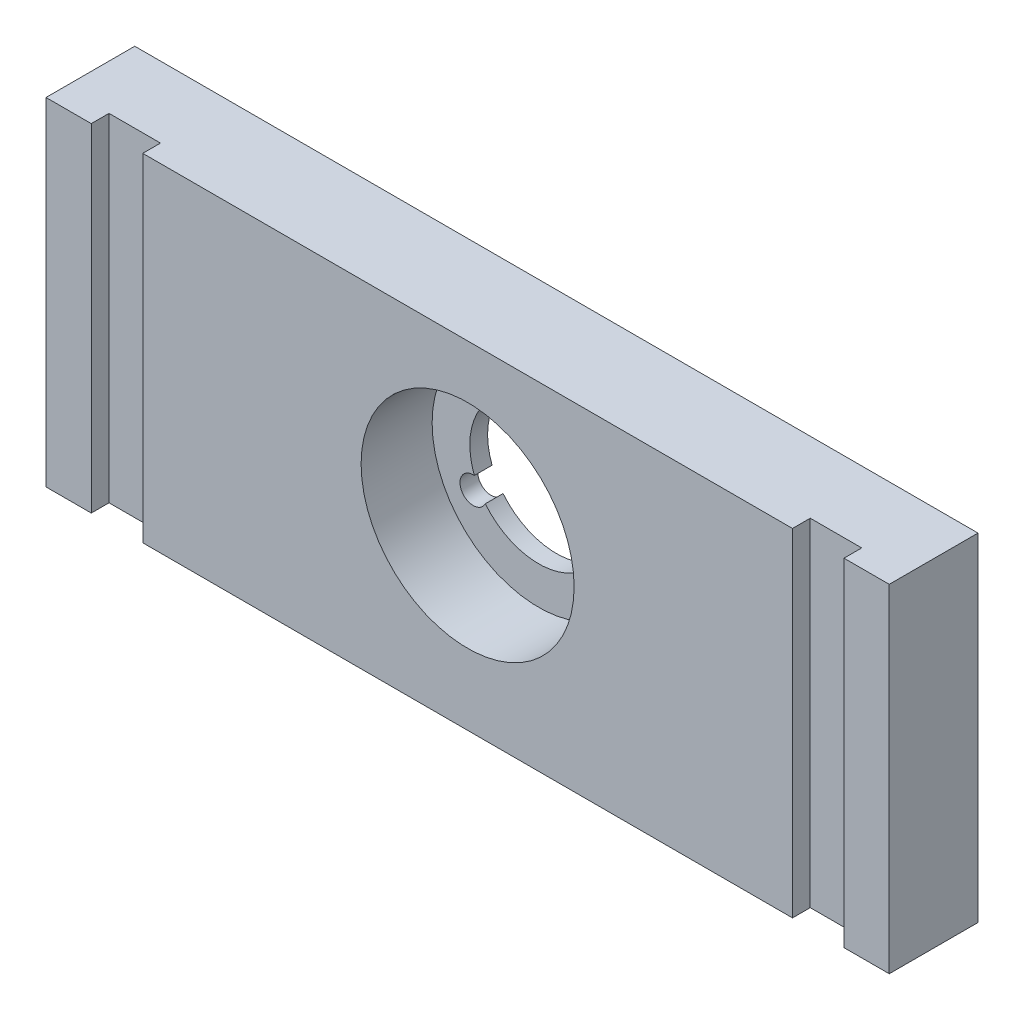
ISO-10303-21;
HEADER;
FILE_DESCRIPTION(('STEP AP214'),'2;1');
FILE_NAME('part.step','',(''),(''),'','','');
FILE_SCHEMA(('AUTOMOTIVE_DESIGN { 1 0 10303 214 1 1 1 1 }'));
ENDSEC;
DATA;
#1=APPLICATION_CONTEXT('core data for automotive mechanical design processes');
#2=APPLICATION_PROTOCOL_DEFINITION('international standard','automotive_design',2000,#1);
#3=PRODUCT_CONTEXT('',#1,'mechanical');
#4=PRODUCT('Part','Part','',(#3));
#5=PRODUCT_RELATED_PRODUCT_CATEGORY('part','',(#4));
#6=PRODUCT_DEFINITION_FORMATION('','',#4);
#7=PRODUCT_DEFINITION_CONTEXT('part definition',#1,'design');
#8=PRODUCT_DEFINITION('design','',#6,#7);
#9=PRODUCT_DEFINITION_SHAPE('','',#8);
#10=(LENGTH_UNIT() NAMED_UNIT(*) SI_UNIT(.MILLI.,.METRE.));
#11=(NAMED_UNIT(*) PLANE_ANGLE_UNIT() SI_UNIT($,.RADIAN.));
#12=(NAMED_UNIT(*) SI_UNIT($,.STERADIAN.) SOLID_ANGLE_UNIT());
#13=UNCERTAINTY_MEASURE_WITH_UNIT(LENGTH_MEASURE(1.E-05),#10,'distance_accuracy_value','');
#14=(GEOMETRIC_REPRESENTATION_CONTEXT(3) GLOBAL_UNCERTAINTY_ASSIGNED_CONTEXT((#13)) GLOBAL_UNIT_ASSIGNED_CONTEXT((#10,
#11,#12)) REPRESENTATION_CONTEXT('',''));
#15=CARTESIAN_POINT('',(0.,0.,0.));
#16=DIRECTION('',(0.,0.,1.));
#17=DIRECTION('',(1.,0.,0.));
#18=AXIS2_PLACEMENT_3D('',#15,#16,#17);
#19=CARTESIAN_POINT('',(0.,0.,10.));
#20=DIRECTION('',(0.,0.,-1.));
#21=DIRECTION('',(-1.,0.,0.));
#22=AXIS2_PLACEMENT_3D('',#19,#20,#21);
#23=PLANE('',#22);
#24=CARTESIAN_POINT('',(47.5,-18.,10.));
#25=DIRECTION('',(0.,0.,1.));
#26=DIRECTION('',(1.,0.,0.));
#27=AXIS2_PLACEMENT_3D('',#24,#25,#26);
#28=CIRCLE('',#27,12.);
#29=CARTESIAN_POINT('',(59.5,-18.,10.));
#30=VERTEX_POINT('',#29);
#31=EDGE_CURVE('E207',#30,#30,#28,.T.);
#32=ORIENTED_EDGE('',*,*,#31,.F.);
#33=EDGE_LOOP('',(#32));
#34=FACE_BOUND('',#33,.T.);
#35=DIRECTION('',(1.,0.,0.));
#36=VECTOR('',#35,1.);
#37=CARTESIAN_POINT('',(95.,-38.,10.));
#38=LINE('',#37,#36);
#39=CARTESIAN_POINT('',(10.9,-38.,10.));
#40=VERTEX_POINT('',#39);
#41=CARTESIAN_POINT('',(84.1,-38.,10.));
#42=VERTEX_POINT('',#41);
#43=EDGE_CURVE('E274',#40,#42,#38,.T.);
#44=ORIENTED_EDGE('',*,*,#43,.T.);
#45=DIRECTION('',(0.,-1.,0.));
#46=VECTOR('',#45,1.);
#47=CARTESIAN_POINT('',(84.1,-38.,10.));
#48=LINE('',#47,#46);
#49=CARTESIAN_POINT('',(84.1,0.,10.));
#50=VERTEX_POINT('',#49);
#51=EDGE_CURVE('E161',#50,#42,#48,.T.);
#52=ORIENTED_EDGE('',*,*,#51,.F.);
#53=DIRECTION('',(-1.,0.,0.));
#54=VECTOR('',#53,1.);
#55=CARTESIAN_POINT('',(0.,0.,10.));
#56=LINE('',#55,#54);
#57=CARTESIAN_POINT('',(10.9,0.,10.));
#58=VERTEX_POINT('',#57);
#59=EDGE_CURVE('E281',#50,#58,#56,.T.);
#60=ORIENTED_EDGE('',*,*,#59,.T.);
#61=DIRECTION('',(0.,1.,0.));
#62=VECTOR('',#61,1.);
#63=CARTESIAN_POINT('',(10.9,-38.,10.));
#64=LINE('',#63,#62);
#65=EDGE_CURVE('E186',#40,#58,#64,.T.);
#66=ORIENTED_EDGE('',*,*,#65,.F.);
#67=EDGE_LOOP('',(#44,#52,#60,#66));
#68=FACE_BOUND('',#67,.T.);
#69=ADVANCED_FACE('F31',(#34,#68),#23,.F.);
#70=CARTESIAN_POINT('',(0.,-38.,10.));
#71=VERTEX_POINT('',#70);
#72=CARTESIAN_POINT('',(5.1,-38.,10.));
#73=VERTEX_POINT('',#72);
#74=EDGE_CURVE('E270',#71,#73,#38,.T.);
#75=ORIENTED_EDGE('',*,*,#74,.T.);
#76=DIRECTION('',(0.,-1.,0.));
#77=VECTOR('',#76,1.);
#78=CARTESIAN_POINT('',(5.1,-38.,10.));
#79=LINE('',#78,#77);
#80=CARTESIAN_POINT('',(5.10000000000001,0.,10.));
#81=VERTEX_POINT('',#80);
#82=EDGE_CURVE('E193',#81,#73,#79,.T.);
#83=ORIENTED_EDGE('',*,*,#82,.F.);
#84=CARTESIAN_POINT('',(0.,0.,10.));
#85=VERTEX_POINT('',#84);
#86=EDGE_CURVE('E276',#81,#85,#56,.T.);
#87=ORIENTED_EDGE('',*,*,#86,.T.);
#88=DIRECTION('',(0.,-1.,0.));
#89=VECTOR('',#88,1.);
#90=CARTESIAN_POINT('',(0.,-38.,10.));
#91=LINE('',#90,#89);
#92=EDGE_CURVE('E265',#85,#71,#91,.T.);
#93=ORIENTED_EDGE('',*,*,#92,.T.);
#94=EDGE_LOOP('',(#75,#83,#87,#93));
#95=FACE_BOUND('',#94,.T.);
#96=ADVANCED_FACE('F334',(#95),#23,.F.);
#97=CARTESIAN_POINT('',(47.5,-18.,10.));
#98=DIRECTION('',(0.,0.,-1.));
#99=DIRECTION('',(-1.,0.,0.));
#100=AXIS2_PLACEMENT_3D('',#97,#98,#99);
#101=CYLINDRICAL_SURFACE('',#100,7.75);
#102=DIRECTION('',(0.,0.,-1.));
#103=VECTOR('',#102,1.);
#104=CARTESIAN_POINT('',(54.7439441639615,-20.7545912490619,10.));
#105=LINE('',#104,#103);
#106=CARTESIAN_POINT('',(54.7439441639615,-20.7545912490619,2.));
#107=VERTEX_POINT('',#106);
#108=CARTESIAN_POINT('',(54.7439441639615,-20.7545912490619,0.));
#109=VERTEX_POINT('',#108);
#110=EDGE_CURVE('E252',#107,#109,#105,.T.);
#111=ORIENTED_EDGE('',*,*,#110,.F.);
#112=CARTESIAN_POINT('',(47.5,-18.,2.));
#113=DIRECTION('',(0.,0.,1.));
#114=DIRECTION('',(1.,0.,0.));
#115=AXIS2_PLACEMENT_3D('',#112,#113,#114);
#116=CIRCLE('',#115,7.75);
#117=CARTESIAN_POINT('',(48.7364260832507,-10.3492647058823,2.));
#118=VERTEX_POINT('',#117);
#119=EDGE_CURVE('E231',#107,#118,#116,.T.);
#120=ORIENTED_EDGE('',*,*,#119,.T.);
#121=DIRECTION('',(0.,0.,-1.));
#122=VECTOR('',#121,1.);
#123=CARTESIAN_POINT('',(48.7364260832507,-10.3492647058823,10.));
#124=LINE('',#123,#122);
#125=CARTESIAN_POINT('',(48.7364260832507,-10.3492647058823,0.));
#126=VERTEX_POINT('',#125);
#127=EDGE_CURVE('E262',#118,#126,#124,.T.);
#128=ORIENTED_EDGE('',*,*,#127,.T.);
#129=CARTESIAN_POINT('',(47.5,-18.,0.));
#130=DIRECTION('',(0.,0.,1.));
#131=DIRECTION('',(1.,0.,0.));
#132=AXIS2_PLACEMENT_3D('',#129,#130,#131);
#133=CIRCLE('',#132,7.75);
#134=EDGE_CURVE('E234',#109,#126,#133,.T.);
#135=ORIENTED_EDGE('',*,*,#134,.F.);
#136=EDGE_LOOP('',(#111,#120,#128,#135));
#137=FACE_BOUND('',#136,.T.);
#138=ADVANCED_FACE('F336',(#137),#101,.F.);
#139=CARTESIAN_POINT('',(47.5,-9.49999999999996,10.));
#140=DIRECTION('',(0.,0.,-1.));
#141=DIRECTION('',(-1.,0.,0.));
#142=AXIS2_PLACEMENT_3D('',#139,#140,#141);
#143=CYLINDRICAL_SURFACE('',#142,1.5);
#144=ORIENTED_EDGE('',*,*,#127,.F.);
#145=CARTESIAN_POINT('',(47.5,-9.49999999999996,2.));
#146=DIRECTION('',(0.,0.,1.));
#147=DIRECTION('',(1.,0.,0.));
#148=AXIS2_PLACEMENT_3D('',#145,#146,#147);
#149=CIRCLE('',#148,1.5);
#150=CARTESIAN_POINT('',(46.2635739167494,-10.3492647058823,2.));
#151=VERTEX_POINT('',#150);
#152=EDGE_CURVE('E228',#118,#151,#149,.T.);
#153=ORIENTED_EDGE('',*,*,#152,.T.);
#154=DIRECTION('',(0.,0.,-1.));
#155=VECTOR('',#154,1.);
#156=CARTESIAN_POINT('',(46.2635739167494,-10.3492647058823,10.));
#157=LINE('',#156,#155);
#158=CARTESIAN_POINT('',(46.2635739167494,-10.3492647058823,0.));
#159=VERTEX_POINT('',#158);
#160=EDGE_CURVE('E260',#151,#159,#157,.T.);
#161=ORIENTED_EDGE('',*,*,#160,.T.);
#162=CARTESIAN_POINT('',(47.5,-9.49999999999996,0.));
#163=DIRECTION('',(0.,0.,1.));
#164=DIRECTION('',(1.,0.,0.));
#165=AXIS2_PLACEMENT_3D('',#162,#163,#164);
#166=CIRCLE('',#165,1.5);
#167=EDGE_CURVE('E237',#126,#159,#166,.T.);
#168=ORIENTED_EDGE('',*,*,#167,.F.);
#169=EDGE_LOOP('',(#144,#153,#161,#168));
#170=FACE_BOUND('',#169,.T.);
#171=ADVANCED_FACE('F342',(#170),#143,.F.);
#172=CARTESIAN_POINT('',(47.5,-18.,10.));
#173=DIRECTION('',(0.,0.,-1.));
#174=DIRECTION('',(-1.,0.,0.));
#175=AXIS2_PLACEMENT_3D('',#172,#173,#174);
#176=CYLINDRICAL_SURFACE('',#175,7.75);
#177=ORIENTED_EDGE('',*,*,#160,.F.);
#178=CARTESIAN_POINT('',(47.5,-18.,2.));
#179=DIRECTION('',(0.,0.,1.));
#180=DIRECTION('',(1.,0.,0.));
#181=AXIS2_PLACEMENT_3D('',#178,#179,#180);
#182=CIRCLE('',#181,7.75);
#183=CARTESIAN_POINT('',(40.2560558360386,-20.754591249062,2.));
#184=VERTEX_POINT('',#183);
#185=EDGE_CURVE('E225',#151,#184,#182,.T.);
#186=ORIENTED_EDGE('',*,*,#185,.T.);
#187=DIRECTION('',(0.,0.,-1.));
#188=VECTOR('',#187,1.);
#189=CARTESIAN_POINT('',(40.2560558360386,-20.754591249062,10.));
#190=LINE('',#189,#188);
#191=CARTESIAN_POINT('',(40.2560558360386,-20.754591249062,0.));
#192=VERTEX_POINT('',#191);
#193=EDGE_CURVE('E258',#184,#192,#190,.T.);
#194=ORIENTED_EDGE('',*,*,#193,.T.);
#195=CARTESIAN_POINT('',(47.5,-18.,0.));
#196=DIRECTION('',(0.,0.,1.));
#197=DIRECTION('',(1.,0.,0.));
#198=AXIS2_PLACEMENT_3D('',#195,#196,#197);
#199=CIRCLE('',#198,7.75);
#200=EDGE_CURVE('E240',#159,#192,#199,.T.);
#201=ORIENTED_EDGE('',*,*,#200,.F.);
#202=EDGE_LOOP('',(#177,#186,#194,#201));
#203=FACE_BOUND('',#202,.T.);
#204=ADVANCED_FACE('F369',(#203),#176,.F.);
#205=CARTESIAN_POINT('',(40.1387840678324,-22.25,10.));
#206=DIRECTION('',(0.,0.,-1.));
#207=DIRECTION('',(-1.,0.,0.));
#208=AXIS2_PLACEMENT_3D('',#205,#206,#207);
#209=CYLINDRICAL_SURFACE('',#208,1.5);
#210=ORIENTED_EDGE('',*,*,#193,.F.);
#211=CARTESIAN_POINT('',(40.1387840678324,-22.25,2.));
#212=DIRECTION('',(0.,0.,1.));
#213=DIRECTION('',(1.,0.,0.));
#214=AXIS2_PLACEMENT_3D('',#211,#212,#213);
#215=CIRCLE('',#214,1.5);
#216=CARTESIAN_POINT('',(41.4924819192894,-22.8961440450557,2.));
#217=VERTEX_POINT('',#216);
#218=EDGE_CURVE('E222',#184,#217,#215,.T.);
#219=ORIENTED_EDGE('',*,*,#218,.T.);
#220=DIRECTION('',(0.,0.,-1.));
#221=VECTOR('',#220,1.);
#222=CARTESIAN_POINT('',(41.4924819192894,-22.8961440450557,10.));
#223=LINE('',#222,#221);
#224=CARTESIAN_POINT('',(41.4924819192894,-22.8961440450557,0.));
#225=VERTEX_POINT('',#224);
#226=EDGE_CURVE('E256',#217,#225,#223,.T.);
#227=ORIENTED_EDGE('',*,*,#226,.T.);
#228=CARTESIAN_POINT('',(40.1387840678324,-22.25,0.));
#229=DIRECTION('',(0.,0.,1.));
#230=DIRECTION('',(1.,0.,0.));
#231=AXIS2_PLACEMENT_3D('',#228,#229,#230);
#232=CIRCLE('',#231,1.5);
#233=EDGE_CURVE('E243',#192,#225,#232,.T.);
#234=ORIENTED_EDGE('',*,*,#233,.F.);
#235=EDGE_LOOP('',(#210,#219,#227,#234));
#236=FACE_BOUND('',#235,.T.);
#237=ADVANCED_FACE('F359',(#236),#209,.F.);
#238=CARTESIAN_POINT('',(47.5,-18.,10.));
#239=DIRECTION('',(0.,0.,-1.));
#240=DIRECTION('',(-1.,0.,0.));
#241=AXIS2_PLACEMENT_3D('',#238,#239,#240);
#242=CYLINDRICAL_SURFACE('',#241,7.75);
#243=ORIENTED_EDGE('',*,*,#226,.F.);
#244=CARTESIAN_POINT('',(47.5,-18.,2.));
#245=DIRECTION('',(0.,0.,1.));
#246=DIRECTION('',(1.,0.,0.));
#247=AXIS2_PLACEMENT_3D('',#244,#245,#246);
#248=CIRCLE('',#247,7.75);
#249=CARTESIAN_POINT('',(53.5075180807109,-22.8961440450554,2.));
#250=VERTEX_POINT('',#249);
#251=EDGE_CURVE('E217',#217,#250,#248,.T.);
#252=ORIENTED_EDGE('',*,*,#251,.T.);
#253=DIRECTION('',(0.,0.,-1.));
#254=VECTOR('',#253,1.);
#255=CARTESIAN_POINT('',(53.5075180807109,-22.8961440450554,10.));
#256=LINE('',#255,#254);
#257=CARTESIAN_POINT('',(53.5075180807109,-22.8961440450554,0.));
#258=VERTEX_POINT('',#257);
#259=EDGE_CURVE('E254',#250,#258,#256,.T.);
#260=ORIENTED_EDGE('',*,*,#259,.T.);
#261=CARTESIAN_POINT('',(47.5,-18.,0.));
#262=DIRECTION('',(0.,0.,1.));
#263=DIRECTION('',(1.,0.,0.));
#264=AXIS2_PLACEMENT_3D('',#261,#262,#263);
#265=CIRCLE('',#264,7.75);
#266=EDGE_CURVE('E246',#225,#258,#265,.T.);
#267=ORIENTED_EDGE('',*,*,#266,.F.);
#268=EDGE_LOOP('',(#243,#252,#260,#267));
#269=FACE_BOUND('',#268,.T.);
#270=ADVANCED_FACE('F353',(#269),#242,.F.);
#271=CARTESIAN_POINT('',(54.8612159321678,-22.2499999999998,10.));
#272=DIRECTION('',(0.,0.,-1.));
#273=DIRECTION('',(-1.,0.,0.));
#274=AXIS2_PLACEMENT_3D('',#271,#272,#273);
#275=CYLINDRICAL_SURFACE('',#274,1.5);
#276=ORIENTED_EDGE('',*,*,#259,.F.);
#277=CARTESIAN_POINT('',(54.8612159321678,-22.2499999999998,2.));
#278=DIRECTION('',(0.,0.,1.));
#279=DIRECTION('',(1.,0.,0.));
#280=AXIS2_PLACEMENT_3D('',#277,#278,#279);
#281=CIRCLE('',#280,1.5);
#282=EDGE_CURVE('E11',#250,#107,#281,.T.);
#283=ORIENTED_EDGE('',*,*,#282,.T.);
#284=ORIENTED_EDGE('',*,*,#110,.T.);
#285=CARTESIAN_POINT('',(54.8612159321678,-22.2499999999998,0.));
#286=DIRECTION('',(0.,0.,1.));
#287=DIRECTION('',(1.,0.,0.));
#288=AXIS2_PLACEMENT_3D('',#285,#286,#287);
#289=CIRCLE('',#288,1.5);
#290=EDGE_CURVE('E249',#258,#109,#289,.T.);
#291=ORIENTED_EDGE('',*,*,#290,.F.);
#292=EDGE_LOOP('',(#276,#283,#284,#291));
#293=FACE_BOUND('',#292,.T.);
#294=ADVANCED_FACE('F348',(#293),#275,.F.);
#295=CARTESIAN_POINT('',(95.,0.,10.));
#296=VERTEX_POINT('',#295);
#297=CARTESIAN_POINT('',(89.9,0.,10.));
#298=VERTEX_POINT('',#297);
#299=EDGE_CURVE('E277',#296,#298,#56,.T.);
#300=ORIENTED_EDGE('',*,*,#299,.T.);
#301=DIRECTION('',(0.,1.,0.));
#302=VECTOR('',#301,1.);
#303=CARTESIAN_POINT('',(89.9,-38.,10.));
#304=LINE('',#303,#302);
#305=CARTESIAN_POINT('',(89.9,-38.,10.));
#306=VERTEX_POINT('',#305);
#307=EDGE_CURVE('E174',#306,#298,#304,.T.);
#308=ORIENTED_EDGE('',*,*,#307,.F.);
#309=CARTESIAN_POINT('',(95.,-38.,10.));
#310=VERTEX_POINT('',#309);
#311=EDGE_CURVE('E268',#306,#310,#38,.T.);
#312=ORIENTED_EDGE('',*,*,#311,.T.);
#313=DIRECTION('',(0.,1.,0.));
#314=VECTOR('',#313,1.);
#315=CARTESIAN_POINT('',(95.,0.,10.));
#316=LINE('',#315,#314);
#317=EDGE_CURVE('E273',#310,#296,#316,.T.);
#318=ORIENTED_EDGE('',*,*,#317,.T.);
#319=EDGE_LOOP('',(#300,#308,#312,#318));
#320=FACE_BOUND('',#319,.T.);
#321=ADVANCED_FACE('F318',(#320),#23,.F.);
#322=CARTESIAN_POINT('',(0.,0.,0.));
#323=DIRECTION('',(0.,0.,-1.));
#324=DIRECTION('',(-1.,0.,0.));
#325=AXIS2_PLACEMENT_3D('',#322,#323,#324);
#326=PLANE('',#325);
#327=DIRECTION('',(0.,-1.,0.));
#328=VECTOR('',#327,1.);
#329=CARTESIAN_POINT('',(0.,-38.,0.));
#330=LINE('',#329,#328);
#331=CARTESIAN_POINT('',(0.,0.,0.));
#332=VERTEX_POINT('',#331);
#333=CARTESIAN_POINT('',(0.,-38.,0.));
#334=VERTEX_POINT('',#333);
#335=EDGE_CURVE('E264',#332,#334,#330,.T.);
#336=ORIENTED_EDGE('',*,*,#335,.F.);
#337=DIRECTION('',(-1.,0.,0.));
#338=VECTOR('',#337,1.);
#339=CARTESIAN_POINT('',(0.,0.,0.));
#340=LINE('',#339,#338);
#341=CARTESIAN_POINT('',(95.,0.,0.));
#342=VERTEX_POINT('',#341);
#343=EDGE_CURVE('E269',#342,#332,#340,.T.);
#344=ORIENTED_EDGE('',*,*,#343,.F.);
#345=DIRECTION('',(0.,1.,0.));
#346=VECTOR('',#345,1.);
#347=CARTESIAN_POINT('',(95.,0.,0.));
#348=LINE('',#347,#346);
#349=CARTESIAN_POINT('',(95.,-38.,0.));
#350=VERTEX_POINT('',#349);
#351=EDGE_CURVE('E286',#350,#342,#348,.T.);
#352=ORIENTED_EDGE('',*,*,#351,.F.);
#353=DIRECTION('',(1.,0.,0.));
#354=VECTOR('',#353,1.);
#355=CARTESIAN_POINT('',(95.,-38.,0.));
#356=LINE('',#355,#354);
#357=EDGE_CURVE('E284',#334,#350,#356,.T.);
#358=ORIENTED_EDGE('',*,*,#357,.F.);
#359=EDGE_LOOP('',(#336,#344,#352,#358));
#360=FACE_BOUND('',#359,.T.);
#361=ORIENTED_EDGE('',*,*,#290,.T.);
#362=ORIENTED_EDGE('',*,*,#134,.T.);
#363=ORIENTED_EDGE('',*,*,#167,.T.);
#364=ORIENTED_EDGE('',*,*,#200,.T.);
#365=ORIENTED_EDGE('',*,*,#233,.T.);
#366=ORIENTED_EDGE('',*,*,#266,.T.);
#367=EDGE_LOOP('',(#361,#362,#363,#364,#365,#366));
#368=FACE_BOUND('',#367,.T.);
#369=ADVANCED_FACE('F305',(#360,#368),#326,.T.);
#370=CARTESIAN_POINT('',(0.,-38.,10.));
#371=DIRECTION('',(1.,0.,0.));
#372=DIRECTION('',(0.,0.,-1.));
#373=AXIS2_PLACEMENT_3D('',#370,#371,#372);
#374=PLANE('',#373);
#375=ORIENTED_EDGE('',*,*,#335,.T.);
#376=DIRECTION('',(0.,0.,-1.));
#377=VECTOR('',#376,1.);
#378=CARTESIAN_POINT('',(0.,-38.,10.));
#379=LINE('',#378,#377);
#380=EDGE_CURVE('E39',#71,#334,#379,.T.);
#381=ORIENTED_EDGE('',*,*,#380,.F.);
#382=ORIENTED_EDGE('',*,*,#92,.F.);
#383=DIRECTION('',(0.,0.,-1.));
#384=VECTOR('',#383,1.);
#385=CARTESIAN_POINT('',(0.,0.,10.));
#386=LINE('',#385,#384);
#387=EDGE_CURVE('E280',#85,#332,#386,.T.);
#388=ORIENTED_EDGE('',*,*,#387,.T.);
#389=EDGE_LOOP('',(#375,#381,#382,#388));
#390=FACE_BOUND('',#389,.T.);
#391=ADVANCED_FACE('F33',(#390),#374,.F.);
#392=CARTESIAN_POINT('',(95.,-38.,10.));
#393=DIRECTION('',(0.,1.,0.));
#394=DIRECTION('',(-1.,0.,0.));
#395=AXIS2_PLACEMENT_3D('',#392,#393,#394);
#396=PLANE('',#395);
#397=DIRECTION('',(1.,0.,0.));
#398=VECTOR('',#397,1.);
#399=CARTESIAN_POINT('',(84.1,-38.,8.));
#400=LINE('',#399,#398);
#401=CARTESIAN_POINT('',(84.1,-38.,8.));
#402=VERTEX_POINT('',#401);
#403=CARTESIAN_POINT('',(89.9,-38.,8.));
#404=VERTEX_POINT('',#403);
#405=EDGE_CURVE('E170',#402,#404,#400,.T.);
#406=ORIENTED_EDGE('',*,*,#405,.F.);
#407=DIRECTION('',(0.,0.,1.));
#408=VECTOR('',#407,1.);
#409=CARTESIAN_POINT('',(84.1,-38.,8.));
#410=LINE('',#409,#408);
#411=EDGE_CURVE('E156',#402,#42,#410,.T.);
#412=ORIENTED_EDGE('',*,*,#411,.T.);
#413=ORIENTED_EDGE('',*,*,#43,.F.);
#414=DIRECTION('',(0.,0.,1.));
#415=VECTOR('',#414,1.);
#416=CARTESIAN_POINT('',(10.9,-38.,8.));
#417=LINE('',#416,#415);
#418=CARTESIAN_POINT('',(10.9,-38.,8.));
#419=VERTEX_POINT('',#418);
#420=EDGE_CURVE('E200',#419,#40,#417,.T.);
#421=ORIENTED_EDGE('',*,*,#420,.F.);
#422=DIRECTION('',(1.,0.,0.));
#423=VECTOR('',#422,1.);
#424=CARTESIAN_POINT('',(10.9,-38.,8.));
#425=LINE('',#424,#423);
#426=CARTESIAN_POINT('',(5.1,-38.,8.));
#427=VERTEX_POINT('',#426);
#428=EDGE_CURVE('E191',#427,#419,#425,.T.);
#429=ORIENTED_EDGE('',*,*,#428,.F.);
#430=DIRECTION('',(0.,0.,1.));
#431=VECTOR('',#430,1.);
#432=CARTESIAN_POINT('',(5.1,-38.,8.));
#433=LINE('',#432,#431);
#434=EDGE_CURVE('E204',#427,#73,#433,.T.);
#435=ORIENTED_EDGE('',*,*,#434,.T.);
#436=ORIENTED_EDGE('',*,*,#74,.F.);
#437=ORIENTED_EDGE('',*,*,#380,.T.);
#438=ORIENTED_EDGE('',*,*,#357,.T.);
#439=DIRECTION('',(0.,0.,-1.));
#440=VECTOR('',#439,1.);
#441=CARTESIAN_POINT('',(95.,-38.,10.));
#442=LINE('',#441,#440);
#443=EDGE_CURVE('E294',#310,#350,#442,.T.);
#444=ORIENTED_EDGE('',*,*,#443,.F.);
#445=ORIENTED_EDGE('',*,*,#311,.F.);
#446=DIRECTION('',(0.,0.,1.));
#447=VECTOR('',#446,1.);
#448=CARTESIAN_POINT('',(89.9,-38.,8.));
#449=LINE('',#448,#447);
#450=EDGE_CURVE('E166',#404,#306,#449,.T.);
#451=ORIENTED_EDGE('',*,*,#450,.F.);
#452=EDGE_LOOP('',(#406,#412,#413,#421,#429,#435,#436,#437,#438,#444,#445,#451));
#453=FACE_BOUND('',#452,.T.);
#454=ADVANCED_FACE('F176',(#453),#396,.F.);
#455=CARTESIAN_POINT('',(95.,0.,10.));
#456=DIRECTION('',(-1.,0.,0.));
#457=DIRECTION('',(0.,0.,1.));
#458=AXIS2_PLACEMENT_3D('',#455,#456,#457);
#459=PLANE('',#458);
#460=ORIENTED_EDGE('',*,*,#351,.T.);
#461=DIRECTION('',(0.,0.,-1.));
#462=VECTOR('',#461,1.);
#463=CARTESIAN_POINT('',(95.,0.,10.));
#464=LINE('',#463,#462);
#465=EDGE_CURVE('E291',#296,#342,#464,.T.);
#466=ORIENTED_EDGE('',*,*,#465,.F.);
#467=ORIENTED_EDGE('',*,*,#317,.F.);
#468=ORIENTED_EDGE('',*,*,#443,.T.);
#469=EDGE_LOOP('',(#460,#466,#467,#468));
#470=FACE_BOUND('',#469,.T.);
#471=ADVANCED_FACE('F310',(#470),#459,.F.);
#472=CARTESIAN_POINT('',(0.,0.,10.));
#473=DIRECTION('',(0.,-1.,0.));
#474=DIRECTION('',(0.,0.,-1.));
#475=AXIS2_PLACEMENT_3D('',#472,#473,#474);
#476=PLANE('',#475);
#477=ORIENTED_EDGE('',*,*,#59,.F.);
#478=DIRECTION('',(0.,0.,1.));
#479=VECTOR('',#478,1.);
#480=CARTESIAN_POINT('',(84.1,0.,8.));
#481=LINE('',#480,#479);
#482=CARTESIAN_POINT('',(84.1,0.,8.));
#483=VERTEX_POINT('',#482);
#484=EDGE_CURVE('E184',#483,#50,#481,.T.);
#485=ORIENTED_EDGE('',*,*,#484,.F.);
#486=DIRECTION('',(-1.,0.,0.));
#487=VECTOR('',#486,1.);
#488=CARTESIAN_POINT('',(89.9,0.,8.));
#489=LINE('',#488,#487);
#490=CARTESIAN_POINT('',(89.9,0.,8.));
#491=VERTEX_POINT('',#490);
#492=EDGE_CURVE('E167',#491,#483,#489,.T.);
#493=ORIENTED_EDGE('',*,*,#492,.F.);
#494=DIRECTION('',(0.,0.,1.));
#495=VECTOR('',#494,1.);
#496=CARTESIAN_POINT('',(89.9,0.,8.));
#497=LINE('',#496,#495);
#498=EDGE_CURVE('E187',#491,#298,#497,.T.);
#499=ORIENTED_EDGE('',*,*,#498,.T.);
#500=ORIENTED_EDGE('',*,*,#299,.F.);
#501=ORIENTED_EDGE('',*,*,#465,.T.);
#502=ORIENTED_EDGE('',*,*,#343,.T.);
#503=ORIENTED_EDGE('',*,*,#387,.F.);
#504=ORIENTED_EDGE('',*,*,#86,.F.);
#505=DIRECTION('',(0.,0.,1.));
#506=VECTOR('',#505,1.);
#507=CARTESIAN_POINT('',(5.10000000000001,0.,8.));
#508=LINE('',#507,#506);
#509=CARTESIAN_POINT('',(5.10000000000001,0.,8.));
#510=VERTEX_POINT('',#509);
#511=EDGE_CURVE('E208',#510,#81,#508,.T.);
#512=ORIENTED_EDGE('',*,*,#511,.F.);
#513=DIRECTION('',(-1.,0.,0.));
#514=VECTOR('',#513,1.);
#515=CARTESIAN_POINT('',(5.10000000000001,0.,8.));
#516=LINE('',#515,#514);
#517=CARTESIAN_POINT('',(10.9,0.,8.));
#518=VERTEX_POINT('',#517);
#519=EDGE_CURVE('E195',#518,#510,#516,.T.);
#520=ORIENTED_EDGE('',*,*,#519,.F.);
#521=DIRECTION('',(0.,0.,1.));
#522=VECTOR('',#521,1.);
#523=CARTESIAN_POINT('',(10.9,0.,8.));
#524=LINE('',#523,#522);
#525=EDGE_CURVE('E210',#518,#58,#524,.T.);
#526=ORIENTED_EDGE('',*,*,#525,.T.);
#527=EDGE_LOOP('',(#477,#485,#493,#499,#500,#501,#502,#503,#504,#512,#520,#526));
#528=FACE_BOUND('',#527,.T.);
#529=ADVANCED_FACE('F315',(#528),#476,.F.);
#530=CARTESIAN_POINT('',(47.5,-18.,2.));
#531=DIRECTION('',(0.,0.,1.));
#532=DIRECTION('',(1.,0.,0.));
#533=AXIS2_PLACEMENT_3D('',#530,#531,#532);
#534=CYLINDRICAL_SURFACE('',#533,12.);
#535=CARTESIAN_POINT('',(47.5,-18.,2.));
#536=DIRECTION('',(0.,0.,1.));
#537=DIRECTION('',(1.,0.,0.));
#538=AXIS2_PLACEMENT_3D('',#535,#536,#537);
#539=CIRCLE('',#538,12.);
#540=CARTESIAN_POINT('',(59.5,-18.,2.));
#541=VERTEX_POINT('',#540);
#542=EDGE_CURVE('E214',#541,#541,#539,.T.);
#543=ORIENTED_EDGE('',*,*,#542,.F.);
#544=EDGE_LOOP('',(#543));
#545=FACE_BOUND('',#544,.T.);
#546=ORIENTED_EDGE('',*,*,#31,.T.);
#547=EDGE_LOOP('',(#546));
#548=FACE_BOUND('',#547,.T.);
#549=ADVANCED_FACE('F364',(#545,#548),#534,.F.);
#550=CARTESIAN_POINT('',(47.5,-18.,2.));
#551=DIRECTION('',(0.,0.,1.));
#552=DIRECTION('',(1.,0.,0.));
#553=AXIS2_PLACEMENT_3D('',#550,#551,#552);
#554=PLANE('',#553);
#555=ORIENTED_EDGE('',*,*,#282,.F.);
#556=ORIENTED_EDGE('',*,*,#251,.F.);
#557=ORIENTED_EDGE('',*,*,#218,.F.);
#558=ORIENTED_EDGE('',*,*,#185,.F.);
#559=ORIENTED_EDGE('',*,*,#152,.F.);
#560=ORIENTED_EDGE('',*,*,#119,.F.);
#561=EDGE_LOOP('',(#555,#556,#557,#558,#559,#560));
#562=FACE_BOUND('',#561,.T.);
#563=ORIENTED_EDGE('',*,*,#542,.T.);
#564=EDGE_LOOP('',(#563));
#565=FACE_BOUND('',#564,.T.);
#566=ADVANCED_FACE('F384',(#562,#565),#554,.T.);
#567=CARTESIAN_POINT('',(5.1,-38.,8.));
#568=DIRECTION('',(-1.,0.,0.));
#569=DIRECTION('',(0.,-1.,0.));
#570=AXIS2_PLACEMENT_3D('',#567,#568,#569);
#571=PLANE('',#570);
#572=ORIENTED_EDGE('',*,*,#82,.T.);
#573=ORIENTED_EDGE('',*,*,#434,.F.);
#574=DIRECTION('',(0.,-1.,0.));
#575=VECTOR('',#574,1.);
#576=CARTESIAN_POINT('',(5.1,-38.,8.));
#577=LINE('',#576,#575);
#578=EDGE_CURVE('E197',#510,#427,#577,.T.);
#579=ORIENTED_EDGE('',*,*,#578,.F.);
#580=ORIENTED_EDGE('',*,*,#511,.T.);
#581=EDGE_LOOP('',(#572,#573,#579,#580));
#582=FACE_BOUND('',#581,.T.);
#583=ADVANCED_FACE('F330',(#582),#571,.F.);
#584=CARTESIAN_POINT('',(10.9,-38.,8.));
#585=DIRECTION('',(1.,0.,0.));
#586=DIRECTION('',(0.,1.,0.));
#587=AXIS2_PLACEMENT_3D('',#584,#585,#586);
#588=PLANE('',#587);
#589=ORIENTED_EDGE('',*,*,#65,.T.);
#590=ORIENTED_EDGE('',*,*,#525,.F.);
#591=DIRECTION('',(0.,1.,0.));
#592=VECTOR('',#591,1.);
#593=CARTESIAN_POINT('',(10.9,-38.,8.));
#594=LINE('',#593,#592);
#595=EDGE_CURVE('E54',#419,#518,#594,.T.);
#596=ORIENTED_EDGE('',*,*,#595,.F.);
#597=ORIENTED_EDGE('',*,*,#420,.T.);
#598=EDGE_LOOP('',(#589,#590,#596,#597));
#599=FACE_BOUND('',#598,.T.);
#600=ADVANCED_FACE('F324',(#599),#588,.F.);
#601=CARTESIAN_POINT('',(5.1,-38.,8.));
#602=DIRECTION('',(0.,0.,-1.));
#603=DIRECTION('',(-1.,0.,0.));
#604=AXIS2_PLACEMENT_3D('',#601,#602,#603);
#605=PLANE('',#604);
#606=ORIENTED_EDGE('',*,*,#428,.T.);
#607=ORIENTED_EDGE('',*,*,#595,.T.);
#608=ORIENTED_EDGE('',*,*,#519,.T.);
#609=ORIENTED_EDGE('',*,*,#578,.T.);
#610=EDGE_LOOP('',(#606,#607,#608,#609));
#611=FACE_BOUND('',#610,.T.);
#612=ADVANCED_FACE('F326',(#611),#605,.F.);
#613=CARTESIAN_POINT('',(84.1,-38.,8.));
#614=DIRECTION('',(-1.,0.,0.));
#615=DIRECTION('',(0.,-1.,0.));
#616=AXIS2_PLACEMENT_3D('',#613,#614,#615);
#617=PLANE('',#616);
#618=ORIENTED_EDGE('',*,*,#51,.T.);
#619=ORIENTED_EDGE('',*,*,#411,.F.);
#620=DIRECTION('',(0.,-1.,0.));
#621=VECTOR('',#620,1.);
#622=CARTESIAN_POINT('',(84.1,-38.,8.));
#623=LINE('',#622,#621);
#624=EDGE_CURVE('E159',#483,#402,#623,.T.);
#625=ORIENTED_EDGE('',*,*,#624,.F.);
#626=ORIENTED_EDGE('',*,*,#484,.T.);
#627=EDGE_LOOP('',(#618,#619,#625,#626));
#628=FACE_BOUND('',#627,.T.);
#629=ADVANCED_FACE('F158',(#628),#617,.F.);
#630=CARTESIAN_POINT('',(89.9,-38.,8.));
#631=DIRECTION('',(1.,0.,0.));
#632=DIRECTION('',(0.,1.,0.));
#633=AXIS2_PLACEMENT_3D('',#630,#631,#632);
#634=PLANE('',#633);
#635=ORIENTED_EDGE('',*,*,#307,.T.);
#636=ORIENTED_EDGE('',*,*,#498,.F.);
#637=DIRECTION('',(0.,1.,0.));
#638=VECTOR('',#637,1.);
#639=CARTESIAN_POINT('',(89.9,-38.,8.));
#640=LINE('',#639,#638);
#641=EDGE_CURVE('E46',#404,#491,#640,.T.);
#642=ORIENTED_EDGE('',*,*,#641,.F.);
#643=ORIENTED_EDGE('',*,*,#450,.T.);
#644=EDGE_LOOP('',(#635,#636,#642,#643));
#645=FACE_BOUND('',#644,.T.);
#646=ADVANCED_FACE('F511',(#645),#634,.F.);
#647=CARTESIAN_POINT('',(84.1,0.,8.));
#648=DIRECTION('',(0.,0.,1.));
#649=DIRECTION('',(1.,0.,0.));
#650=AXIS2_PLACEMENT_3D('',#647,#648,#649);
#651=PLANE('',#650);
#652=ORIENTED_EDGE('',*,*,#624,.T.);
#653=ORIENTED_EDGE('',*,*,#405,.T.);
#654=ORIENTED_EDGE('',*,*,#641,.T.);
#655=ORIENTED_EDGE('',*,*,#492,.T.);
#656=EDGE_LOOP('',(#652,#653,#654,#655));
#657=FACE_BOUND('',#656,.T.);
#658=ADVANCED_FACE('F169',(#657),#651,.T.);
#659=CLOSED_SHELL('',(#69,#96,#138,#171,#204,#237,#270,#294,#321,#369,#391,#454,#471,#529,#549,
#566,#583,#600,#612,#629,#646,#658));
#660=MANIFOLD_SOLID_BREP('B2',#659);
#661=ADVANCED_BREP_SHAPE_REPRESENTATION('',(#18,#660),#14);
#662=SHAPE_DEFINITION_REPRESENTATION(#9,#661);
ENDSEC;
END-ISO-10303-21;
